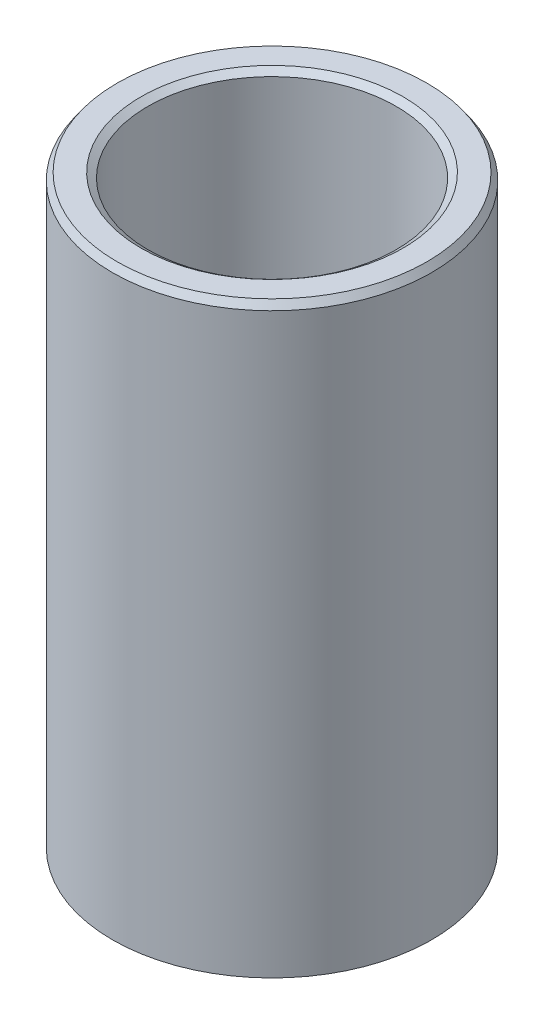
ISO-10303-21;
HEADER;
FILE_DESCRIPTION(('STEP AP214'),'2;1');
FILE_NAME('part.step','',(''),(''),'','','');
FILE_SCHEMA(('AUTOMOTIVE_DESIGN { 1 0 10303 214 1 1 1 1 }'));
ENDSEC;
DATA;
#1=APPLICATION_CONTEXT('core data for automotive mechanical design processes');
#2=APPLICATION_PROTOCOL_DEFINITION('international standard','automotive_design',2000,#1);
#3=PRODUCT_CONTEXT('',#1,'mechanical');
#4=PRODUCT('Part','Part','',(#3));
#5=PRODUCT_RELATED_PRODUCT_CATEGORY('part','',(#4));
#6=PRODUCT_DEFINITION_FORMATION('','',#4);
#7=PRODUCT_DEFINITION_CONTEXT('part definition',#1,'design');
#8=PRODUCT_DEFINITION('design','',#6,#7);
#9=PRODUCT_DEFINITION_SHAPE('','',#8);
#10=(LENGTH_UNIT() NAMED_UNIT(*) SI_UNIT(.MILLI.,.METRE.));
#11=(NAMED_UNIT(*) PLANE_ANGLE_UNIT() SI_UNIT($,.RADIAN.));
#12=(NAMED_UNIT(*) SI_UNIT($,.STERADIAN.) SOLID_ANGLE_UNIT());
#13=UNCERTAINTY_MEASURE_WITH_UNIT(LENGTH_MEASURE(1.E-05),#10,'distance_accuracy_value','');
#14=(GEOMETRIC_REPRESENTATION_CONTEXT(3) GLOBAL_UNCERTAINTY_ASSIGNED_CONTEXT((#13)) GLOBAL_UNIT_ASSIGNED_CONTEXT((#10,
#11,#12)) REPRESENTATION_CONTEXT('',''));
#15=CARTESIAN_POINT('',(0.,0.,0.));
#16=DIRECTION('',(0.,0.,1.));
#17=DIRECTION('',(1.,0.,0.));
#18=AXIS2_PLACEMENT_3D('',#15,#16,#17);
#19=CARTESIAN_POINT('',(0.,138.474839878337,0.));
#20=DIRECTION('',(0.,-1.,0.));
#21=DIRECTION('',(0.,0.,-1.));
#22=AXIS2_PLACEMENT_3D('',#19,#20,#21);
#23=CYLINDRICAL_SURFACE('',#22,37.5);
#24=CARTESIAN_POINT('',(0.,1.13256461632086,0.));
#25=DIRECTION('',(0.,1.,0.));
#26=DIRECTION('',(0.,0.,1.));
#27=AXIS2_PLACEMENT_3D('',#24,#25,#26);
#28=CIRCLE('',#27,37.5);
#29=CARTESIAN_POINT('',(0.,1.13256461632086,37.5));
#30=VERTEX_POINT('',#29);
#31=EDGE_CURVE('E10',#30,#30,#28,.T.);
#32=ORIENTED_EDGE('',*,*,#31,.T.);
#33=EDGE_LOOP('',(#32));
#34=FACE_BOUND('',#33,.T.);
#35=CARTESIAN_POINT('',(0.,136.846541481687,0.));
#36=DIRECTION('',(0.,1.,0.));
#37=DIRECTION('',(0.,0.,1.));
#38=AXIS2_PLACEMENT_3D('',#35,#36,#37);
#39=CIRCLE('',#38,37.5);
#40=CARTESIAN_POINT('',(0.,136.846541481687,37.5));
#41=VERTEX_POINT('',#40);
#42=EDGE_CURVE('E50',#41,#41,#39,.F.);
#43=ORIENTED_EDGE('',*,*,#42,.T.);
#44=EDGE_LOOP('',(#43));
#45=FACE_BOUND('',#44,.T.);
#46=ADVANCED_FACE('F39',(#34,#45),#23,.T.);
#47=CARTESIAN_POINT('',(0.,138.474839878337,0.));
#48=DIRECTION('',(0.,1.,0.));
#49=DIRECTION('',(0.,0.,1.));
#50=AXIS2_PLACEMENT_3D('',#47,#48,#49);
#51=PLANE('',#50);
#52=CARTESIAN_POINT('',(0.,138.474839878337,0.));
#53=DIRECTION('',(0.,1.,0.));
#54=DIRECTION('',(0.,0.,1.));
#55=AXIS2_PLACEMENT_3D('',#52,#53,#54);
#56=CIRCLE('',#55,30.7967197332341);
#57=CARTESIAN_POINT('',(0.,138.474839878337,30.7967197332341));
#58=VERTEX_POINT('',#57);
#59=EDGE_CURVE('E58',#58,#58,#56,.F.);
#60=ORIENTED_EDGE('',*,*,#59,.T.);
#61=EDGE_LOOP('',(#60));
#62=FACE_BOUND('',#61,.T.);
#63=CARTESIAN_POINT('',(0.,138.474839878337,0.));
#64=DIRECTION('',(0.,1.,0.));
#65=DIRECTION('',(0.,0.,1.));
#66=AXIS2_PLACEMENT_3D('',#63,#64,#65);
#67=CIRCLE('',#66,36.3674353836791);
#68=CARTESIAN_POINT('',(0.,138.474839878337,36.3674353836791));
#69=VERTEX_POINT('',#68);
#70=EDGE_CURVE('E61',#69,#69,#67,.T.);
#71=ORIENTED_EDGE('',*,*,#70,.T.);
#72=EDGE_LOOP('',(#71));
#73=FACE_BOUND('',#72,.T.);
#74=ADVANCED_FACE('F88',(#62,#73),#51,.T.);
#75=CARTESIAN_POINT('',(0.,0.,0.));
#76=DIRECTION('',(0.,1.,0.));
#77=DIRECTION('',(0.,0.,1.));
#78=AXIS2_PLACEMENT_3D('',#75,#76,#77);
#79=PLANE('',#78);
#80=CARTESIAN_POINT('',(0.,0.,0.));
#81=DIRECTION('',(0.,1.,0.));
#82=DIRECTION('',(0.,0.,1.));
#83=AXIS2_PLACEMENT_3D('',#80,#81,#82);
#84=CIRCLE('',#83,30.300985952905);
#85=CARTESIAN_POINT('',(0.,0.,30.300985952905));
#86=VERTEX_POINT('',#85);
#87=EDGE_CURVE('E51',#86,#86,#84,.T.);
#88=ORIENTED_EDGE('',*,*,#87,.T.);
#89=EDGE_LOOP('',(#88));
#90=FACE_BOUND('',#89,.T.);
#91=CARTESIAN_POINT('',(0.,0.,0.));
#92=DIRECTION('',(0.,1.,0.));
#93=DIRECTION('',(0.,0.,1.));
#94=AXIS2_PLACEMENT_3D('',#91,#92,#93);
#95=CIRCLE('',#94,35.87170160335);
#96=CARTESIAN_POINT('',(0.,0.,35.87170160335));
#97=VERTEX_POINT('',#96);
#98=EDGE_CURVE('E54',#97,#97,#95,.F.);
#99=ORIENTED_EDGE('',*,*,#98,.T.);
#100=EDGE_LOOP('',(#99));
#101=FACE_BOUND('',#100,.T.);
#102=ADVANCED_FACE('F83',(#90,#101),#79,.F.);
#103=CARTESIAN_POINT('',(0.,138.474839878337,0.));
#104=DIRECTION('',(0.,-1.,0.));
#105=DIRECTION('',(0.,0.,-1.));
#106=AXIS2_PLACEMENT_3D('',#103,#104,#105);
#107=CYLINDRICAL_SURFACE('',#106,29.1684213365842);
#108=CARTESIAN_POINT('',(0.,137.342275262016,0.));
#109=DIRECTION('',(0.,1.,0.));
#110=DIRECTION('',(0.,0.,1.));
#111=AXIS2_PLACEMENT_3D('',#108,#109,#110);
#112=CIRCLE('',#111,29.1684213365842);
#113=CARTESIAN_POINT('',(0.,137.342275262016,29.1684213365842));
#114=VERTEX_POINT('',#113);
#115=EDGE_CURVE('E67',#114,#114,#112,.T.);
#116=ORIENTED_EDGE('',*,*,#115,.T.);
#117=EDGE_LOOP('',(#116));
#118=FACE_BOUND('',#117,.T.);
#119=CARTESIAN_POINT('',(0.,1.62829839665002,0.));
#120=DIRECTION('',(0.,1.,0.));
#121=DIRECTION('',(0.,0.,1.));
#122=AXIS2_PLACEMENT_3D('',#119,#120,#121);
#123=CIRCLE('',#122,29.1684213365842);
#124=CARTESIAN_POINT('',(0.,1.62829839665002,29.1684213365842));
#125=VERTEX_POINT('',#124);
#126=EDGE_CURVE('E69',#125,#125,#123,.F.);
#127=ORIENTED_EDGE('',*,*,#126,.T.);
#128=EDGE_LOOP('',(#127));
#129=FACE_BOUND('',#128,.T.);
#130=ADVANCED_FACE('F71',(#118,#129),#107,.F.);
#131=CARTESIAN_POINT('',(0.,137.342275262016,0.));
#132=DIRECTION('',(0.,1.,0.));
#133=DIRECTION('',(0.,0.,1.));
#134=AXIS2_PLACEMENT_3D('',#131,#132,#133);
#135=CONICAL_SURFACE('',#134,29.1684213365842,0.963062497708134);
#136=ORIENTED_EDGE('',*,*,#59,.F.);
#137=EDGE_LOOP('',(#136));
#138=FACE_BOUND('',#137,.T.);
#139=ORIENTED_EDGE('',*,*,#115,.F.);
#140=EDGE_LOOP('',(#139));
#141=FACE_BOUND('',#140,.T.);
#142=ADVANCED_FACE('F77',(#138,#141),#135,.F.);
#143=CARTESIAN_POINT('',(0.,0.,0.));
#144=DIRECTION('',(0.,-1.,0.));
#145=DIRECTION('',(0.,0.,-1.));
#146=AXIS2_PLACEMENT_3D('',#143,#144,#145);
#147=CONICAL_SURFACE('',#146,30.300985952905,0.607733829086751);
#148=ORIENTED_EDGE('',*,*,#126,.F.);
#149=EDGE_LOOP('',(#148));
#150=FACE_BOUND('',#149,.T.);
#151=ORIENTED_EDGE('',*,*,#87,.F.);
#152=EDGE_LOOP('',(#151));
#153=FACE_BOUND('',#152,.T.);
#154=ADVANCED_FACE('F73',(#150,#153),#147,.F.);
#155=CARTESIAN_POINT('',(0.,1.13256461632086,0.));
#156=DIRECTION('',(0.,1.,0.));
#157=DIRECTION('',(0.,0.,1.));
#158=AXIS2_PLACEMENT_3D('',#155,#156,#157);
#159=CONICAL_SURFACE('',#158,37.5,0.963062497708146);
#160=ORIENTED_EDGE('',*,*,#98,.F.);
#161=EDGE_LOOP('',(#160));
#162=FACE_BOUND('',#161,.T.);
#163=ORIENTED_EDGE('',*,*,#31,.F.);
#164=EDGE_LOOP('',(#163));
#165=FACE_BOUND('',#164,.T.);
#166=ADVANCED_FACE('F76',(#162,#165),#159,.T.);
#167=CARTESIAN_POINT('',(0.,138.474839878337,0.));
#168=DIRECTION('',(0.,-1.,0.));
#169=DIRECTION('',(0.,0.,-1.));
#170=AXIS2_PLACEMENT_3D('',#167,#168,#169);
#171=CONICAL_SURFACE('',#170,36.3674353836791,0.607733829086748);
#172=ORIENTED_EDGE('',*,*,#42,.F.);
#173=EDGE_LOOP('',(#172));
#174=FACE_BOUND('',#173,.T.);
#175=ORIENTED_EDGE('',*,*,#70,.F.);
#176=EDGE_LOOP('',(#175));
#177=FACE_BOUND('',#176,.T.);
#178=ADVANCED_FACE('F45',(#174,#177),#171,.T.);
#179=CLOSED_SHELL('',(#46,#74,#102,#130,#142,#154,#166,#178));
#180=MANIFOLD_SOLID_BREP('B2',#179);
#181=ADVANCED_BREP_SHAPE_REPRESENTATION('',(#18,#180),#14);
#182=SHAPE_DEFINITION_REPRESENTATION(#9,#181);
ENDSEC;
END-ISO-10303-21;
